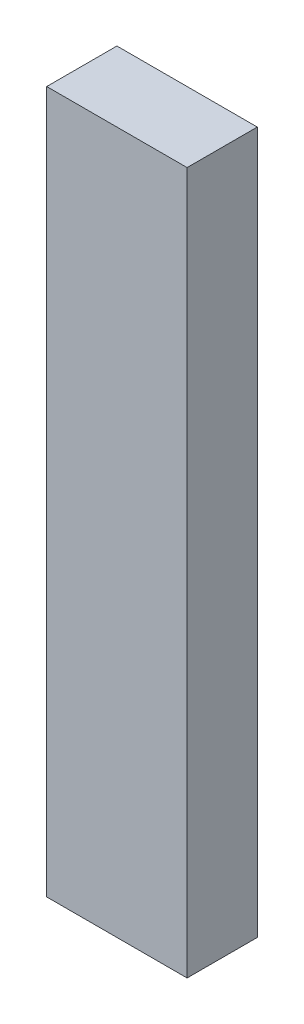
ISO-10303-21;
HEADER;
FILE_DESCRIPTION(('STEP AP214'),'2;1');
FILE_NAME('part.step','',(''),(''),'','','');
FILE_SCHEMA(('AUTOMOTIVE_DESIGN { 1 0 10303 214 1 1 1 1 }'));
ENDSEC;
DATA;
#1=APPLICATION_CONTEXT('core data for automotive mechanical design processes');
#2=APPLICATION_PROTOCOL_DEFINITION('international standard','automotive_design',2000,#1);
#3=PRODUCT_CONTEXT('',#1,'mechanical');
#4=PRODUCT('Part','Part','',(#3));
#5=PRODUCT_RELATED_PRODUCT_CATEGORY('part','',(#4));
#6=PRODUCT_DEFINITION_FORMATION('','',#4);
#7=PRODUCT_DEFINITION_CONTEXT('part definition',#1,'design');
#8=PRODUCT_DEFINITION('design','',#6,#7);
#9=PRODUCT_DEFINITION_SHAPE('','',#8);
#10=(LENGTH_UNIT() NAMED_UNIT(*) SI_UNIT(.MILLI.,.METRE.));
#11=(NAMED_UNIT(*) PLANE_ANGLE_UNIT() SI_UNIT($,.RADIAN.));
#12=(NAMED_UNIT(*) SI_UNIT($,.STERADIAN.) SOLID_ANGLE_UNIT());
#13=UNCERTAINTY_MEASURE_WITH_UNIT(LENGTH_MEASURE(1.E-05),#10,'distance_accuracy_value','');
#14=(GEOMETRIC_REPRESENTATION_CONTEXT(3) GLOBAL_UNCERTAINTY_ASSIGNED_CONTEXT((#13)) GLOBAL_UNIT_ASSIGNED_CONTEXT((#10,
#11,#12)) REPRESENTATION_CONTEXT('',''));
#15=CARTESIAN_POINT('',(0.,0.,0.));
#16=DIRECTION('',(0.,0.,1.));
#17=DIRECTION('',(1.,0.,0.));
#18=AXIS2_PLACEMENT_3D('',#15,#16,#17);
#19=CARTESIAN_POINT('',(0.,0.,2.));
#20=DIRECTION('',(1.,0.,0.));
#21=DIRECTION('',(0.,0.,-1.));
#22=AXIS2_PLACEMENT_3D('',#19,#20,#21);
#23=PLANE('',#22);
#24=DIRECTION('',(0.,-1.,0.));
#25=VECTOR('',#24,1.);
#26=CARTESIAN_POINT('',(0.,0.,0.));
#27=LINE('',#26,#25);
#28=CARTESIAN_POINT('',(0.,20.,0.));
#29=VERTEX_POINT('',#28);
#30=CARTESIAN_POINT('',(0.,0.,0.));
#31=VERTEX_POINT('',#30);
#32=EDGE_CURVE('E113',#29,#31,#27,.T.);
#33=ORIENTED_EDGE('',*,*,#32,.T.);
#34=DIRECTION('',(0.,0.,-1.));
#35=VECTOR('',#34,1.);
#36=CARTESIAN_POINT('',(0.,0.,2.));
#37=LINE('',#36,#35);
#38=CARTESIAN_POINT('',(0.,0.,2.));
#39=VERTEX_POINT('',#38);
#40=EDGE_CURVE('E11',#39,#31,#37,.T.);
#41=ORIENTED_EDGE('',*,*,#40,.F.);
#42=DIRECTION('',(0.,-1.,0.));
#43=VECTOR('',#42,1.);
#44=CARTESIAN_POINT('',(0.,0.,2.));
#45=LINE('',#44,#43);
#46=CARTESIAN_POINT('',(0.,20.,2.));
#47=VERTEX_POINT('',#46);
#48=EDGE_CURVE('E97',#47,#39,#45,.T.);
#49=ORIENTED_EDGE('',*,*,#48,.F.);
#50=DIRECTION('',(0.,0.,-1.));
#51=VECTOR('',#50,1.);
#52=CARTESIAN_POINT('',(0.,20.,2.));
#53=LINE('',#52,#51);
#54=EDGE_CURVE('E109',#47,#29,#53,.T.);
#55=ORIENTED_EDGE('',*,*,#54,.T.);
#56=EDGE_LOOP('',(#33,#41,#49,#55));
#57=FACE_BOUND('',#56,.T.);
#58=ADVANCED_FACE('F45',(#57),#23,.F.);
#59=CARTESIAN_POINT('',(0.,0.,2.));
#60=DIRECTION('',(0.,1.,0.));
#61=DIRECTION('',(0.,0.,1.));
#62=AXIS2_PLACEMENT_3D('',#59,#60,#61);
#63=PLANE('',#62);
#64=DIRECTION('',(1.,0.,0.));
#65=VECTOR('',#64,1.);
#66=CARTESIAN_POINT('',(0.,0.,0.));
#67=LINE('',#66,#65);
#68=CARTESIAN_POINT('',(4.,0.,0.));
#69=VERTEX_POINT('',#68);
#70=EDGE_CURVE('E102',#31,#69,#67,.T.);
#71=ORIENTED_EDGE('',*,*,#70,.T.);
#72=DIRECTION('',(0.,0.,-1.));
#73=VECTOR('',#72,1.);
#74=CARTESIAN_POINT('',(4.,0.,2.));
#75=LINE('',#74,#73);
#76=CARTESIAN_POINT('',(4.,0.,2.));
#77=VERTEX_POINT('',#76);
#78=EDGE_CURVE('E54',#77,#69,#75,.T.);
#79=ORIENTED_EDGE('',*,*,#78,.F.);
#80=DIRECTION('',(1.,0.,0.));
#81=VECTOR('',#80,1.);
#82=CARTESIAN_POINT('',(0.,0.,2.));
#83=LINE('',#82,#81);
#84=EDGE_CURVE('E92',#39,#77,#83,.T.);
#85=ORIENTED_EDGE('',*,*,#84,.F.);
#86=ORIENTED_EDGE('',*,*,#40,.T.);
#87=EDGE_LOOP('',(#71,#79,#85,#86));
#88=FACE_BOUND('',#87,.T.);
#89=ADVANCED_FACE('F101',(#88),#63,.F.);
#90=CARTESIAN_POINT('',(4.,0.,2.));
#91=DIRECTION('',(-1.,0.,0.));
#92=DIRECTION('',(0.,0.,1.));
#93=AXIS2_PLACEMENT_3D('',#90,#91,#92);
#94=PLANE('',#93);
#95=DIRECTION('',(0.,1.,0.));
#96=VECTOR('',#95,1.);
#97=CARTESIAN_POINT('',(4.,0.,0.));
#98=LINE('',#97,#96);
#99=CARTESIAN_POINT('',(4.,20.,0.));
#100=VERTEX_POINT('',#99);
#101=EDGE_CURVE('E79',#69,#100,#98,.T.);
#102=ORIENTED_EDGE('',*,*,#101,.T.);
#103=DIRECTION('',(0.,0.,-1.));
#104=VECTOR('',#103,1.);
#105=CARTESIAN_POINT('',(4.,20.,2.));
#106=LINE('',#105,#104);
#107=CARTESIAN_POINT('',(4.,20.,2.));
#108=VERTEX_POINT('',#107);
#109=EDGE_CURVE('E104',#108,#100,#106,.T.);
#110=ORIENTED_EDGE('',*,*,#109,.F.);
#111=DIRECTION('',(0.,1.,0.));
#112=VECTOR('',#111,1.);
#113=CARTESIAN_POINT('',(4.,0.,2.));
#114=LINE('',#113,#112);
#115=EDGE_CURVE('E95',#77,#108,#114,.T.);
#116=ORIENTED_EDGE('',*,*,#115,.F.);
#117=ORIENTED_EDGE('',*,*,#78,.T.);
#118=EDGE_LOOP('',(#102,#110,#116,#117));
#119=FACE_BOUND('',#118,.T.);
#120=ADVANCED_FACE('F105',(#119),#94,.F.);
#121=CARTESIAN_POINT('',(0.,20.,2.));
#122=DIRECTION('',(0.,-1.,0.));
#123=DIRECTION('',(0.,0.,-1.));
#124=AXIS2_PLACEMENT_3D('',#121,#122,#123);
#125=PLANE('',#124);
#126=DIRECTION('',(-1.,0.,0.));
#127=VECTOR('',#126,1.);
#128=CARTESIAN_POINT('',(0.,20.,0.));
#129=LINE('',#128,#127);
#130=EDGE_CURVE('E85',#100,#29,#129,.T.);
#131=ORIENTED_EDGE('',*,*,#130,.T.);
#132=ORIENTED_EDGE('',*,*,#54,.F.);
#133=DIRECTION('',(-1.,0.,0.));
#134=VECTOR('',#133,1.);
#135=CARTESIAN_POINT('',(0.,20.,2.));
#136=LINE('',#135,#134);
#137=EDGE_CURVE('E62',#108,#47,#136,.T.);
#138=ORIENTED_EDGE('',*,*,#137,.F.);
#139=ORIENTED_EDGE('',*,*,#109,.T.);
#140=EDGE_LOOP('',(#131,#132,#138,#139));
#141=FACE_BOUND('',#140,.T.);
#142=ADVANCED_FACE('F126',(#141),#125,.F.);
#143=CARTESIAN_POINT('',(0.,0.,2.));
#144=DIRECTION('',(0.,0.,-1.));
#145=DIRECTION('',(-1.,0.,0.));
#146=AXIS2_PLACEMENT_3D('',#143,#144,#145);
#147=PLANE('',#146);
#148=ORIENTED_EDGE('',*,*,#48,.T.);
#149=ORIENTED_EDGE('',*,*,#84,.T.);
#150=ORIENTED_EDGE('',*,*,#115,.T.);
#151=ORIENTED_EDGE('',*,*,#137,.T.);
#152=EDGE_LOOP('',(#148,#149,#150,#151));
#153=FACE_BOUND('',#152,.T.);
#154=ADVANCED_FACE('F93',(#153),#147,.F.);
#155=CARTESIAN_POINT('',(0.,0.,0.));
#156=DIRECTION('',(0.,0.,-1.));
#157=DIRECTION('',(-1.,0.,0.));
#158=AXIS2_PLACEMENT_3D('',#155,#156,#157);
#159=PLANE('',#158);
#160=ORIENTED_EDGE('',*,*,#32,.F.);
#161=ORIENTED_EDGE('',*,*,#130,.F.);
#162=ORIENTED_EDGE('',*,*,#101,.F.);
#163=ORIENTED_EDGE('',*,*,#70,.F.);
#164=EDGE_LOOP('',(#160,#161,#162,#163));
#165=FACE_BOUND('',#164,.T.);
#166=ADVANCED_FACE('F129',(#165),#159,.T.);
#167=CLOSED_SHELL('',(#58,#89,#120,#142,#154,#166));
#168=MANIFOLD_SOLID_BREP('B2',#167);
#169=ADVANCED_BREP_SHAPE_REPRESENTATION('',(#18,#168),#14);
#170=SHAPE_DEFINITION_REPRESENTATION(#9,#169);
ENDSEC;
END-ISO-10303-21;
